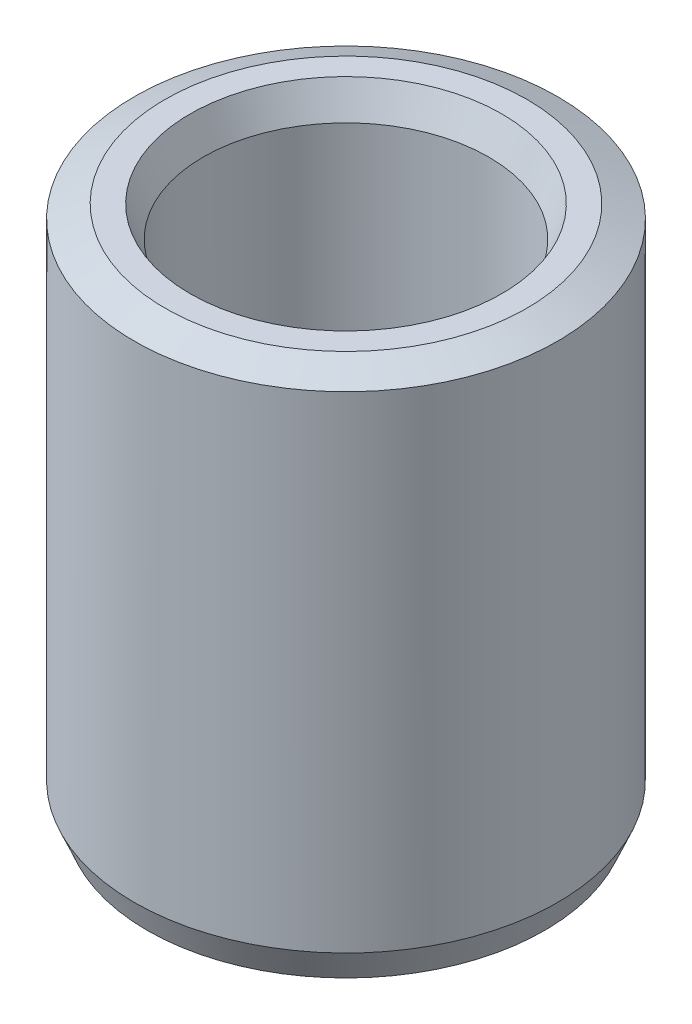
ISO-10303-21;
HEADER;
FILE_DESCRIPTION(('STEP AP214'),'2;1');
FILE_NAME('part.step','',(''),(''),'','','');
FILE_SCHEMA(('AUTOMOTIVE_DESIGN { 1 0 10303 214 1 1 1 1 }'));
ENDSEC;
DATA;
#1=APPLICATION_CONTEXT('core data for automotive mechanical design processes');
#2=APPLICATION_PROTOCOL_DEFINITION('international standard','automotive_design',2000,#1);
#3=PRODUCT_CONTEXT('',#1,'mechanical');
#4=PRODUCT('Part','Part','',(#3));
#5=PRODUCT_RELATED_PRODUCT_CATEGORY('part','',(#4));
#6=PRODUCT_DEFINITION_FORMATION('','',#4);
#7=PRODUCT_DEFINITION_CONTEXT('part definition',#1,'design');
#8=PRODUCT_DEFINITION('design','',#6,#7);
#9=PRODUCT_DEFINITION_SHAPE('','',#8);
#10=(LENGTH_UNIT() NAMED_UNIT(*) SI_UNIT(.MILLI.,.METRE.));
#11=(NAMED_UNIT(*) PLANE_ANGLE_UNIT() SI_UNIT($,.RADIAN.));
#12=(NAMED_UNIT(*) SI_UNIT($,.STERADIAN.) SOLID_ANGLE_UNIT());
#13=UNCERTAINTY_MEASURE_WITH_UNIT(LENGTH_MEASURE(1.E-05),#10,'distance_accuracy_value','');
#14=(GEOMETRIC_REPRESENTATION_CONTEXT(3) GLOBAL_UNCERTAINTY_ASSIGNED_CONTEXT((#13)) GLOBAL_UNIT_ASSIGNED_CONTEXT((#10,
#11,#12)) REPRESENTATION_CONTEXT('',''));
#15=CARTESIAN_POINT('',(0.,0.,0.));
#16=DIRECTION('',(0.,0.,1.));
#17=DIRECTION('',(1.,0.,0.));
#18=AXIS2_PLACEMENT_3D('',#15,#16,#17);
#19=CARTESIAN_POINT('',(0.,137.66781179948,0.));
#20=DIRECTION('',(0.,-1.,0.));
#21=DIRECTION('',(0.,0.,-1.));
#22=AXIS2_PLACEMENT_3D('',#19,#20,#21);
#23=CYLINDRICAL_SURFACE('',#22,55.);
#24=CARTESIAN_POINT('',(0.,8.01065186030092,0.));
#25=DIRECTION('',(0.,1.,0.));
#26=DIRECTION('',(0.,0.,1.));
#27=AXIS2_PLACEMENT_3D('',#24,#25,#26);
#28=CIRCLE('',#27,55.);
#29=CARTESIAN_POINT('',(0.,8.01065186030092,55.));
#30=VERTEX_POINT('',#29);
#31=EDGE_CURVE('E10',#30,#30,#28,.T.);
#32=ORIENTED_EDGE('',*,*,#31,.T.);
#33=EDGE_LOOP('',(#32));
#34=FACE_BOUND('',#33,.T.);
#35=CARTESIAN_POINT('',(0.,134.273303532866,0.));
#36=DIRECTION('',(0.,1.,0.));
#37=DIRECTION('',(0.,0.,1.));
#38=AXIS2_PLACEMENT_3D('',#35,#36,#37);
#39=CIRCLE('',#38,55.);
#40=CARTESIAN_POINT('',(0.,134.273303532866,-55.));
#41=VERTEX_POINT('',#40);
#42=EDGE_CURVE('E50',#41,#41,#39,.F.);
#43=ORIENTED_EDGE('',*,*,#42,.T.);
#44=EDGE_LOOP('',(#43));
#45=FACE_BOUND('',#44,.T.);
#46=ADVANCED_FACE('F39',(#34,#45),#23,.T.);
#47=CARTESIAN_POINT('',(0.,137.66781179948,0.));
#48=DIRECTION('',(0.,1.,0.));
#49=DIRECTION('',(0.,0.,1.));
#50=AXIS2_PLACEMENT_3D('',#47,#48,#49);
#51=PLANE('',#50);
#52=CARTESIAN_POINT('',(0.,137.66781179948,0.));
#53=DIRECTION('',(0.,1.,0.));
#54=DIRECTION('',(0.,0.,1.));
#55=AXIS2_PLACEMENT_3D('',#52,#53,#54);
#56=CIRCLE('',#55,40.4724148774558);
#57=CARTESIAN_POINT('',(0.,137.66781179948,40.4724148774558));
#58=VERTEX_POINT('',#57);
#59=EDGE_CURVE('E58',#58,#58,#56,.F.);
#60=ORIENTED_EDGE('',*,*,#59,.T.);
#61=EDGE_LOOP('',(#60));
#62=FACE_BOUND('',#61,.T.);
#63=CARTESIAN_POINT('',(0.,137.66781179948,0.));
#64=DIRECTION('',(0.,1.,0.));
#65=DIRECTION('',(0.,0.,1.));
#66=AXIS2_PLACEMENT_3D('',#63,#64,#65);
#67=CIRCLE('',#66,46.9893481396991);
#68=CARTESIAN_POINT('',(0.,137.667811799479,-46.9893481396991));
#69=VERTEX_POINT('',#68);
#70=EDGE_CURVE('E61',#69,#69,#67,.T.);
#71=ORIENTED_EDGE('',*,*,#70,.T.);
#72=EDGE_LOOP('',(#71));
#73=FACE_BOUND('',#72,.T.);
#74=ADVANCED_FACE('F88',(#62,#73),#51,.T.);
#75=CARTESIAN_POINT('',(0.,0.,0.));
#76=DIRECTION('',(0.,1.,0.));
#77=DIRECTION('',(0.,0.,1.));
#78=AXIS2_PLACEMENT_3D('',#75,#76,#77);
#79=PLANE('',#78);
#80=CARTESIAN_POINT('',(0.,0.,0.));
#81=DIRECTION('',(0.,1.,0.));
#82=DIRECTION('',(0.,0.,1.));
#83=AXIS2_PLACEMENT_3D('',#80,#81,#82);
#84=CIRCLE('',#83,45.0885584711429);
#85=CARTESIAN_POINT('',(0.,0.,-45.0885584711429));
#86=VERTEX_POINT('',#85);
#87=EDGE_CURVE('E51',#86,#86,#84,.T.);
#88=ORIENTED_EDGE('',*,*,#87,.T.);
#89=EDGE_LOOP('',(#88));
#90=FACE_BOUND('',#89,.T.);
#91=CARTESIAN_POINT('',(0.,0.,0.));
#92=DIRECTION('',(0.,1.,0.));
#93=DIRECTION('',(0.,0.,1.));
#94=AXIS2_PLACEMENT_3D('',#91,#92,#93);
#95=CIRCLE('',#94,51.6054917333861);
#96=CARTESIAN_POINT('',(0.,0.,51.6054917333861));
#97=VERTEX_POINT('',#96);
#98=EDGE_CURVE('E54',#97,#97,#95,.F.);
#99=ORIENTED_EDGE('',*,*,#98,.T.);
#100=EDGE_LOOP('',(#99));
#101=FACE_BOUND('',#100,.T.);
#102=ADVANCED_FACE('F83',(#90,#101),#79,.F.);
#103=CARTESIAN_POINT('',(0.,137.66781179948,0.));
#104=DIRECTION('',(0.,-1.,0.));
#105=DIRECTION('',(0.,0.,-1.));
#106=AXIS2_PLACEMENT_3D('',#103,#104,#105);
#107=CYLINDRICAL_SURFACE('',#106,37.077906610842);
#108=CARTESIAN_POINT('',(0.,129.657159939179,0.));
#109=DIRECTION('',(0.,1.,0.));
#110=DIRECTION('',(0.,0.,1.));
#111=AXIS2_PLACEMENT_3D('',#108,#109,#110);
#112=CIRCLE('',#111,37.077906610842);
#113=CARTESIAN_POINT('',(0.,129.657159939179,37.077906610842));
#114=VERTEX_POINT('',#113);
#115=EDGE_CURVE('E67',#114,#114,#112,.T.);
#116=ORIENTED_EDGE('',*,*,#115,.T.);
#117=EDGE_LOOP('',(#116));
#118=FACE_BOUND('',#117,.T.);
#119=CARTESIAN_POINT('',(0.,3.39450826661386,0.));
#120=DIRECTION('',(0.,1.,0.));
#121=DIRECTION('',(0.,0.,1.));
#122=AXIS2_PLACEMENT_3D('',#119,#120,#121);
#123=CIRCLE('',#122,37.077906610842);
#124=CARTESIAN_POINT('',(0.,3.39450826661386,-37.077906610842));
#125=VERTEX_POINT('',#124);
#126=EDGE_CURVE('E69',#125,#125,#123,.F.);
#127=ORIENTED_EDGE('',*,*,#126,.T.);
#128=EDGE_LOOP('',(#127));
#129=FACE_BOUND('',#128,.T.);
#130=ADVANCED_FACE('F71',(#118,#129),#107,.F.);
#131=CARTESIAN_POINT('',(0.,129.657159939179,0.));
#132=DIRECTION('',(0.,1.,0.));
#133=DIRECTION('',(0.,0.,1.));
#134=AXIS2_PLACEMENT_3D('',#131,#132,#133);
#135=CONICAL_SURFACE('',#134,37.077906610842,0.400810832209768);
#136=ORIENTED_EDGE('',*,*,#59,.F.);
#137=EDGE_LOOP('',(#136));
#138=FACE_BOUND('',#137,.T.);
#139=ORIENTED_EDGE('',*,*,#115,.F.);
#140=EDGE_LOOP('',(#139));
#141=FACE_BOUND('',#140,.T.);
#142=ADVANCED_FACE('F77',(#138,#141),#135,.F.);
#143=CARTESIAN_POINT('',(0.,0.,0.));
#144=DIRECTION('',(0.,-1.,0.));
#145=DIRECTION('',(0.,0.,-1.));
#146=AXIS2_PLACEMENT_3D('',#143,#144,#145);
#147=CONICAL_SURFACE('',#146,45.0885584711429,1.16998549458513);
#148=CARTESIAN_POINT('',(0.,3.39450826661386,-37.077906610842));
#149=CARTESIAN_POINT('',(0.,3.3591488055033,-37.1613509010535));
#150=CARTESIAN_POINT('',(0.,3.32378934439274,-37.2447951912649));
#151=CARTESIAN_POINT('',(0.,3.25307042217162,-37.4116837716879));
#152=CARTESIAN_POINT('',(0.,3.21771096106106,-37.4951280618994));
#153=CARTESIAN_POINT('',(0.,3.14699203883993,-37.6620166423223));
#154=CARTESIAN_POINT('',(0.,3.11163257772937,-37.7454609325338));
#155=CARTESIAN_POINT('',(0.,3.04091365550825,-37.9123495129567));
#156=CARTESIAN_POINT('',(0.,3.00555419439769,-37.9957938031682));
#157=CARTESIAN_POINT('',(0.,2.93483527217657,-38.1626823835911));
#158=CARTESIAN_POINT('',(0.,2.89947581106601,-38.2461266738026));
#159=CARTESIAN_POINT('',(0.,2.82875688884488,-38.4130152542255));
#160=CARTESIAN_POINT('',(0.,2.79339742773432,-38.496459544437));
#161=CARTESIAN_POINT('',(0.,2.7226785055132,-38.6633481248599));
#162=CARTESIAN_POINT('',(0.,2.68731904440264,-38.7467924150714));
#163=CARTESIAN_POINT('',(0.,2.61660012218152,-38.9136809954943));
#164=CARTESIAN_POINT('',(0.,2.58124066107096,-38.9971252857058));
#165=CARTESIAN_POINT('',(0.,2.51052173884983,-39.1640138661287));
#166=CARTESIAN_POINT('',(0.,2.47516227773927,-39.2474581563402));
#167=CARTESIAN_POINT('',(0.,2.40444335551815,-39.4143467367631));
#168=CARTESIAN_POINT('',(0.,2.36908389440759,-39.4977910269746));
#169=CARTESIAN_POINT('',(0.,2.29836497218647,-39.6646796073975));
#170=CARTESIAN_POINT('',(0.,2.26300551107591,-39.748123897609));
#171=CARTESIAN_POINT('',(0.,2.19228658885478,-39.9150124780319));
#172=CARTESIAN_POINT('',(0.,2.15692712774422,-39.9984567682434));
#173=CARTESIAN_POINT('',(0.,2.0862082055231,-40.1653453486663));
#174=CARTESIAN_POINT('',(0.,2.05084874441254,-40.2487896388778));
#175=CARTESIAN_POINT('',(0.,1.98012982219142,-40.4156782193007));
#176=CARTESIAN_POINT('',(0.,1.94477036108086,-40.4991225095122));
#177=CARTESIAN_POINT('',(0.,1.87405143885974,-40.6660110899351));
#178=CARTESIAN_POINT('',(0.,1.83869197774917,-40.7494553801466));
#179=CARTESIAN_POINT('',(0.,1.76797305552805,-40.9163439605695));
#180=CARTESIAN_POINT('',(0.,1.73261359441749,-40.999788250781));
#181=CARTESIAN_POINT('',(0.,1.66189467219637,-41.1666768312039));
#182=CARTESIAN_POINT('',(0.,1.62653521108581,-41.2501211214154));
#183=CARTESIAN_POINT('',(0.,1.55581628886469,-41.4170097018383));
#184=CARTESIAN_POINT('',(0.,1.52045682775412,-41.5004539920498));
#185=CARTESIAN_POINT('',(0.,1.449737905533,-41.6673425724727));
#186=CARTESIAN_POINT('',(0.,1.41437844442244,-41.7507868626842));
#187=CARTESIAN_POINT('',(0.,1.34365952220132,-41.9176754431072));
#188=CARTESIAN_POINT('',(0.,1.30830006109076,-42.0011197333186));
#189=CARTESIAN_POINT('',(0.,1.23758113886964,-42.1680083137416));
#190=CARTESIAN_POINT('',(0.,1.20222167775908,-42.251452603953));
#191=CARTESIAN_POINT('',(0.,1.13150275553795,-42.418341184376));
#192=CARTESIAN_POINT('',(0.,1.09614329442739,-42.5017854745874));
#193=CARTESIAN_POINT('',(0.,1.02542437220627,-42.6686740550104));
#194=CARTESIAN_POINT('',(0.,0.990064911095709,-42.7521183452218));
#195=CARTESIAN_POINT('',(0.,0.919345988874587,-42.9190069256448));
#196=CARTESIAN_POINT('',(0.,0.883986527764026,-43.0024512158562));
#197=CARTESIAN_POINT('',(0.,0.813267605542904,-43.1693397962792));
#198=CARTESIAN_POINT('',(0.,0.777908144432343,-43.2527840864906));
#199=CARTESIAN_POINT('',(0.,0.707189222211221,-43.4196726669136));
#200=CARTESIAN_POINT('',(0.,0.67182976110066,-43.503116957125));
#201=CARTESIAN_POINT('',(0.,0.601110838879538,-43.670005537548));
#202=CARTESIAN_POINT('',(0.,0.565751377768977,-43.7534498277594));
#203=CARTESIAN_POINT('',(0.,0.495032455547855,-43.9203384081824));
#204=CARTESIAN_POINT('',(0.,0.459672994437294,-44.0037826983938));
#205=CARTESIAN_POINT('',(0.,0.388954072216171,-44.1706712788168));
#206=CARTESIAN_POINT('',(0.,0.35359461110561,-44.2541155690283));
#207=CARTESIAN_POINT('',(0.,0.282875688884488,-44.4210041494512));
#208=CARTESIAN_POINT('',(0.,0.247516227773927,-44.5044484396627));
#209=CARTESIAN_POINT('',(0.,0.176797305552805,-44.6713370200856));
#210=CARTESIAN_POINT('',(0.,0.141437844442244,-44.7547813102971));
#211=CARTESIAN_POINT('',(0.,0.0707189222211221,-44.92166989072));
#212=CARTESIAN_POINT('',(0.,0.035359461110561,-45.0051141809315));
#213=CARTESIAN_POINT('',(0.,0.,-45.0885584711429));
#214=B_SPLINE_CURVE_WITH_KNOTS('',3,(#148,#149,#150,#151,#152,#153,#154,#155,#156,#157,#158,
#159,#160,#161,#162,#163,#164,#165,#166,#167,#168,#169,#170,#171,#172,#173,#174,#175,#176,#177,
#178,#179,#180,#181,#182,#183,#184,#185,#186,#187,#188,#189,#190,#191,#192,#193,#194,#195,#196,
#197,#198,#199,#200,#201,#202,#203,#204,#205,#206,#207,#208,#209,#210,#211,#212,#213),
.UNSPECIFIED.,.F.,.F.,(4,2,2,2,2,2,2,2,2,2,2,2,2,2,2,2,2,2,2,2,2,2,2,2,2,2,2,2,2,2,2,2,4),(0.,
0.271880800223783,0.543761600447566,0.815642400671349,1.08752320089513,1.35940400111892,
1.6312848013427,1.90316560156648,2.17504640179026,2.44692720201405,2.71880800223783,
2.99068880246161,3.2625696026854,3.53445040290918,3.80633120313296,4.07821200335675,
4.35009280358053,4.62197360380431,4.8938544040281,5.16573520425188,5.43761600447566,
5.70949680469945,5.98137760492323,6.25325840514701,6.5251392053708,6.79702000559458,
7.06890080581836,7.34078160604215,7.61266240626593,7.88454320648971,8.1564240067135,
8.42830480693728,8.70018560716106),.UNSPECIFIED.);
#215=EDGE_CURVE('BSEAM73',#125,#86,#214,.T.);
#216=ORIENTED_EDGE('',*,*,#126,.F.);
#217=ORIENTED_EDGE('',*,*,#87,.F.);
#218=ORIENTED_EDGE('',*,*,#215,.T.);
#219=ORIENTED_EDGE('',*,*,#215,.F.);
#220=EDGE_LOOP('',(#216,#218,#217,#219));
#221=FACE_BOUND('',#220,.T.);
#222=ADVANCED_FACE('F73',(#221),#147,.F.);
#223=CARTESIAN_POINT('',(0.,8.01065186030092,0.));
#224=DIRECTION('',(0.,1.,0.));
#225=DIRECTION('',(0.,0.,1.));
#226=AXIS2_PLACEMENT_3D('',#223,#224,#225);
#227=CONICAL_SURFACE('',#226,55.,0.400810832209769);
#228=ORIENTED_EDGE('',*,*,#98,.F.);
#229=EDGE_LOOP('',(#228));
#230=FACE_BOUND('',#229,.T.);
#231=ORIENTED_EDGE('',*,*,#31,.F.);
#232=EDGE_LOOP('',(#231));
#233=FACE_BOUND('',#232,.T.);
#234=ADVANCED_FACE('F76',(#230,#233),#227,.T.);
#235=CARTESIAN_POINT('',(0.,137.66781179948,0.));
#236=DIRECTION('',(0.,-1.,0.));
#237=DIRECTION('',(0.,0.,-1.));
#238=AXIS2_PLACEMENT_3D('',#235,#236,#237);
#239=CONICAL_SURFACE('',#238,46.9893481396991,1.16998549458513);
#240=CARTESIAN_POINT('',(0.,134.273303532866,-55.));
#241=CARTESIAN_POINT('',(0.,134.308662993976,-54.9165557097886));
#242=CARTESIAN_POINT('',(0.,134.344022455087,-54.8331114195771));
#243=CARTESIAN_POINT('',(0.,134.414741377308,-54.6662228391542));
#244=CARTESIAN_POINT('',(0.,134.450100838418,-54.5827785489427));
#245=CARTESIAN_POINT('',(0.,134.52081976064,-54.4158899685198));
#246=CARTESIAN_POINT('',(0.,134.55617922175,-54.3324456783083));
#247=CARTESIAN_POINT('',(0.,134.626898143971,-54.1655570978854));
#248=CARTESIAN_POINT('',(0.,134.662257605082,-54.0821128076739));
#249=CARTESIAN_POINT('',(0.,134.732976527303,-53.915224227251));
#250=CARTESIAN_POINT('',(0.,134.768335988413,-53.8317799370395));
#251=CARTESIAN_POINT('',(0.,134.839054910635,-53.6648913566166));
#252=CARTESIAN_POINT('',(0.,134.874414371745,-53.5814470664051));
#253=CARTESIAN_POINT('',(0.,134.945133293966,-53.4145584859821));
#254=CARTESIAN_POINT('',(0.,134.980492755077,-53.3311141957707));
#255=CARTESIAN_POINT('',(0.,135.051211677298,-53.1642256153477));
#256=CARTESIAN_POINT('',(0.,135.086571138409,-53.0807813251363));
#257=CARTESIAN_POINT('',(0.,135.15729006063,-52.9138927447133));
#258=CARTESIAN_POINT('',(0.,135.19264952174,-52.8304484545019));
#259=CARTESIAN_POINT('',(0.,135.263368443961,-52.6635598740789));
#260=CARTESIAN_POINT('',(0.,135.298727905072,-52.5801155838675));
#261=CARTESIAN_POINT('',(0.,135.369446827293,-52.4132270034445));
#262=CARTESIAN_POINT('',(0.,135.404806288404,-52.3297827132331));
#263=CARTESIAN_POINT('',(0.,135.475525210625,-52.1628941328101));
#264=CARTESIAN_POINT('',(0.,135.510884671735,-52.0794498425987));
#265=CARTESIAN_POINT('',(0.,135.581603593956,-51.9125612621757));
#266=CARTESIAN_POINT('',(0.,135.616963055067,-51.8291169719643));
#267=CARTESIAN_POINT('',(0.,135.687681977288,-51.6622283915413));
#268=CARTESIAN_POINT('',(0.,135.723041438399,-51.5787841013299));
#269=CARTESIAN_POINT('',(0.,135.79376036062,-51.4118955209069));
#270=CARTESIAN_POINT('',(0.,135.82911982173,-51.3284512306954));
#271=CARTESIAN_POINT('',(0.,135.899838743951,-51.1615626502725));
#272=CARTESIAN_POINT('',(0.,135.935198205062,-51.078118360061));
#273=CARTESIAN_POINT('',(0.,136.005917127283,-50.9112297796381));
#274=CARTESIAN_POINT('',(0.,136.041276588394,-50.8277854894267));
#275=CARTESIAN_POINT('',(0.,136.111995510615,-50.6608969090037));
#276=CARTESIAN_POINT('',(0.,136.147354971725,-50.5774526187923));
#277=CARTESIAN_POINT('',(0.,136.218073893946,-50.4105640383693));
#278=CARTESIAN_POINT('',(0.,136.253433355057,-50.3271197481578));
#279=CARTESIAN_POINT('',(0.,136.324152277278,-50.1602311677349));
#280=CARTESIAN_POINT('',(0.,136.359511738389,-50.0767868775234));
#281=CARTESIAN_POINT('',(0.,136.43023066061,-49.9098982971005));
#282=CARTESIAN_POINT('',(0.,136.46559012172,-49.826454006889));
#283=CARTESIAN_POINT('',(0.,136.536309043942,-49.6595654264661));
#284=CARTESIAN_POINT('',(0.,136.571668505052,-49.5761211362546));
#285=CARTESIAN_POINT('',(0.,136.642387427273,-49.4092325558317));
#286=CARTESIAN_POINT('',(0.,136.677746888384,-49.3257882656202));
#287=CARTESIAN_POINT('',(0.,136.748465810605,-49.1588996851973));
#288=CARTESIAN_POINT('',(0.,136.783825271715,-49.0754553949858));
#289=CARTESIAN_POINT('',(0.,136.854544193937,-48.9085668145629));
#290=CARTESIAN_POINT('',(0.,136.889903655047,-48.8251225243514));
#291=CARTESIAN_POINT('',(0.,136.960622577268,-48.6582339439285));
#292=CARTESIAN_POINT('',(0.,136.995982038379,-48.574789653717));
#293=CARTESIAN_POINT('',(0.,137.0667009606,-48.4079010732941));
#294=CARTESIAN_POINT('',(0.,137.102060421711,-48.3244567830826));
#295=CARTESIAN_POINT('',(0.,137.172779343932,-48.1575682026597));
#296=CARTESIAN_POINT('',(0.,137.208138805042,-48.0741239124482));
#297=CARTESIAN_POINT('',(0.,137.278857727263,-47.9072353320253));
#298=CARTESIAN_POINT('',(0.,137.314217188374,-47.8237910418138));
#299=CARTESIAN_POINT('',(0.,137.384936110595,-47.6569024613909));
#300=CARTESIAN_POINT('',(0.,137.420295571706,-47.5734581711794));
#301=CARTESIAN_POINT('',(0.,137.491014493927,-47.4065695907565));
#302=CARTESIAN_POINT('',(0.,137.526373955037,-47.323125300545));
#303=CARTESIAN_POINT('',(0.,137.597092877258,-47.1562367201221));
#304=CARTESIAN_POINT('',(0.,137.632452338369,-47.0727924299106));
#305=CARTESIAN_POINT('',(0.,137.66781179948,-46.9893481396991));
#306=B_SPLINE_CURVE_WITH_KNOTS('',3,(#240,#241,#242,#243,#244,#245,#246,#247,#248,#249,#250,
#251,#252,#253,#254,#255,#256,#257,#258,#259,#260,#261,#262,#263,#264,#265,#266,#267,#268,#269,
#270,#271,#272,#273,#274,#275,#276,#277,#278,#279,#280,#281,#282,#283,#284,#285,#286,#287,#288,
#289,#290,#291,#292,#293,#294,#295,#296,#297,#298,#299,#300,#301,#302,#303,#304,#305),
.UNSPECIFIED.,.F.,.F.,(4,2,2,2,2,2,2,2,2,2,2,2,2,2,2,2,2,2,2,2,2,2,2,2,2,2,2,2,2,2,2,2,4),(0.,
0.271880800223793,0.543761600447576,0.815642400671358,1.08752320089514,1.35940400111892,
1.6312848013427,1.90316560156648,2.17504640179026,2.44692720201405,2.71880800223783,
2.99068880246161,3.26256960268539,3.53445040290918,3.80633120313296,4.07821200335674,
4.35009280358052,4.62197360380431,4.89385440402809,5.16573520425188,5.43761600447566,
5.70949680469944,5.98137760492322,6.25325840514701,6.52513920537079,6.79702000559457,
7.06890080581835,7.34078160604214,7.61266240626592,7.8845432064897,8.15642400671348,
8.42830480693726,8.70018560716105),.UNSPECIFIED.);
#307=EDGE_CURVE('BSEAM45',#41,#69,#306,.T.);
#308=ORIENTED_EDGE('',*,*,#42,.F.);
#309=ORIENTED_EDGE('',*,*,#70,.F.);
#310=ORIENTED_EDGE('',*,*,#307,.T.);
#311=ORIENTED_EDGE('',*,*,#307,.F.);
#312=EDGE_LOOP('',(#308,#310,#309,#311));
#313=FACE_BOUND('',#312,.T.);
#314=ADVANCED_FACE('F45',(#313),#239,.T.);
#315=CLOSED_SHELL('',(#46,#74,#102,#130,#142,#222,#234,#314));
#316=MANIFOLD_SOLID_BREP('B2',#315);
#317=ADVANCED_BREP_SHAPE_REPRESENTATION('',(#18,#316),#14);
#318=SHAPE_DEFINITION_REPRESENTATION(#9,#317);
ENDSEC;
END-ISO-10303-21;
